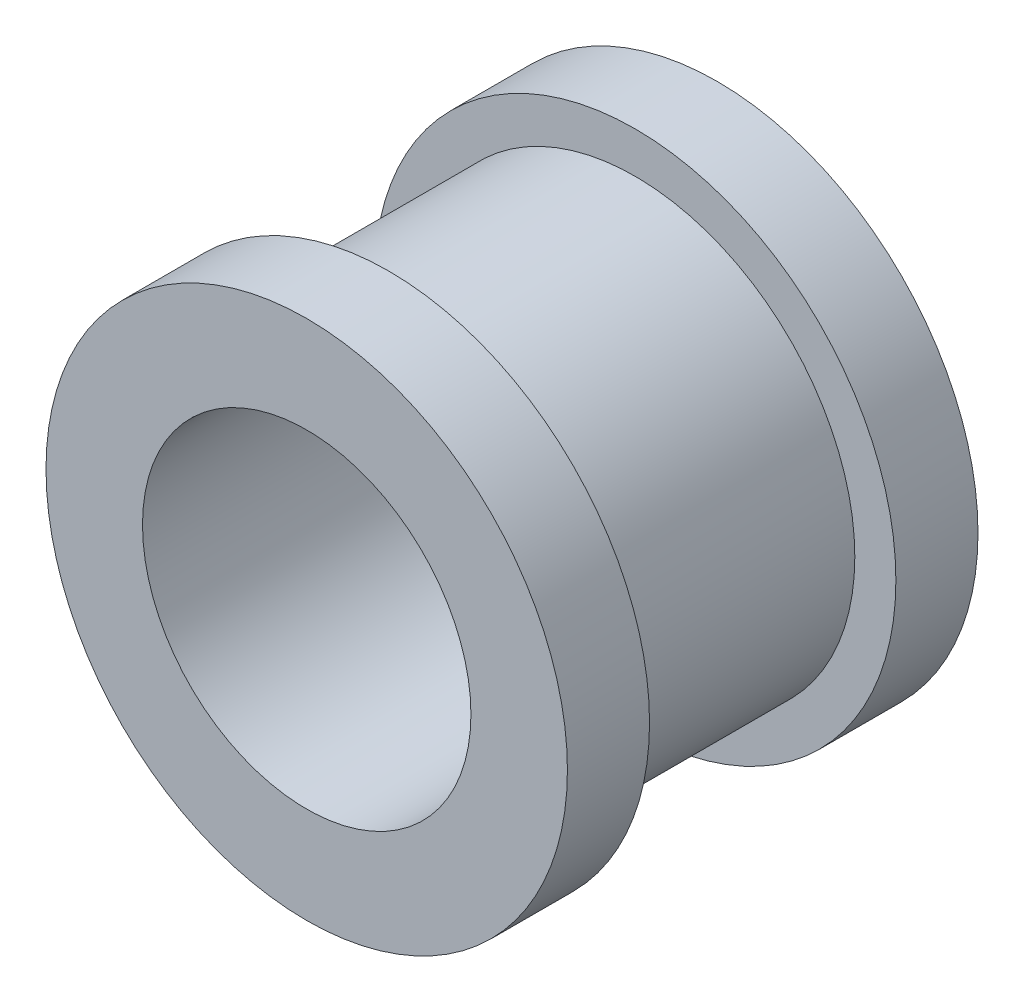
ISO-10303-21;
HEADER;
FILE_DESCRIPTION(('STEP AP214'),'2;1');
FILE_NAME('part.step','',(''),(''),'','','');
FILE_SCHEMA(('AUTOMOTIVE_DESIGN { 1 0 10303 214 1 1 1 1 }'));
ENDSEC;
DATA;
#1=APPLICATION_CONTEXT('core data for automotive mechanical design processes');
#2=APPLICATION_PROTOCOL_DEFINITION('international standard','automotive_design',2000,#1);
#3=PRODUCT_CONTEXT('',#1,'mechanical');
#4=PRODUCT('Part','Part','',(#3));
#5=PRODUCT_RELATED_PRODUCT_CATEGORY('part','',(#4));
#6=PRODUCT_DEFINITION_FORMATION('','',#4);
#7=PRODUCT_DEFINITION_CONTEXT('part definition',#1,'design');
#8=PRODUCT_DEFINITION('design','',#6,#7);
#9=PRODUCT_DEFINITION_SHAPE('','',#8);
#10=(LENGTH_UNIT() NAMED_UNIT(*) SI_UNIT(.MILLI.,.METRE.));
#11=(NAMED_UNIT(*) PLANE_ANGLE_UNIT() SI_UNIT($,.RADIAN.));
#12=(NAMED_UNIT(*) SI_UNIT($,.STERADIAN.) SOLID_ANGLE_UNIT());
#13=UNCERTAINTY_MEASURE_WITH_UNIT(LENGTH_MEASURE(1.E-05),#10,'distance_accuracy_value','');
#14=(GEOMETRIC_REPRESENTATION_CONTEXT(3) GLOBAL_UNCERTAINTY_ASSIGNED_CONTEXT((#13)) GLOBAL_UNIT_ASSIGNED_CONTEXT((#10,
#11,#12)) REPRESENTATION_CONTEXT('',''));
#15=CARTESIAN_POINT('',(0.,0.,0.));
#16=DIRECTION('',(0.,0.,1.));
#17=DIRECTION('',(1.,0.,0.));
#18=AXIS2_PLACEMENT_3D('',#15,#16,#17);
#19=CARTESIAN_POINT('',(0.,0.,10.));
#20=DIRECTION('',(0.,0.,-1.));
#21=DIRECTION('',(-1.,0.,0.));
#22=AXIS2_PLACEMENT_3D('',#19,#20,#21);
#23=CYLINDRICAL_SURFACE('',#22,6.35);
#24=CARTESIAN_POINT('',(0.,0.,0.));
#25=DIRECTION('',(0.,0.,1.));
#26=DIRECTION('',(1.,0.,0.));
#27=AXIS2_PLACEMENT_3D('',#24,#25,#26);
#28=CIRCLE('',#27,6.35);
#29=CARTESIAN_POINT('',(6.35,0.,0.));
#30=VERTEX_POINT('',#29);
#31=EDGE_CURVE('E33',#30,#30,#28,.T.);
#32=ORIENTED_EDGE('',*,*,#31,.T.);
#33=EDGE_LOOP('',(#32));
#34=FACE_BOUND('',#33,.T.);
#35=CARTESIAN_POINT('',(0.,0.,1.99999999999999));
#36=DIRECTION('',(0.,0.,1.));
#37=DIRECTION('',(1.,0.,0.));
#38=AXIS2_PLACEMENT_3D('',#35,#36,#37);
#39=CIRCLE('',#38,6.35);
#40=CARTESIAN_POINT('',(6.35,0.,1.99999999999999));
#41=VERTEX_POINT('',#40);
#42=EDGE_CURVE('E56',#41,#41,#39,.T.);
#43=ORIENTED_EDGE('',*,*,#42,.F.);
#44=EDGE_LOOP('',(#43));
#45=FACE_BOUND('',#44,.T.);
#46=ADVANCED_FACE('F30',(#34,#45),#23,.T.);
#47=CARTESIAN_POINT('',(0.,0.,10.));
#48=DIRECTION('',(0.,0.,1.));
#49=DIRECTION('',(1.,0.,0.));
#50=AXIS2_PLACEMENT_3D('',#47,#48,#49);
#51=CIRCLE('',#50,6.35);
#52=CARTESIAN_POINT('',(6.35,0.,10.));
#53=VERTEX_POINT('',#52);
#54=EDGE_CURVE('E10',#53,#53,#51,.T.);
#55=ORIENTED_EDGE('',*,*,#54,.F.);
#56=EDGE_LOOP('',(#55));
#57=FACE_BOUND('',#56,.T.);
#58=CARTESIAN_POINT('',(0.,0.,8.));
#59=DIRECTION('',(0.,0.,1.));
#60=DIRECTION('',(1.,0.,0.));
#61=AXIS2_PLACEMENT_3D('',#58,#59,#60);
#62=CIRCLE('',#61,6.35);
#63=CARTESIAN_POINT('',(6.35,0.,8.));
#64=VERTEX_POINT('',#63);
#65=EDGE_CURVE('E53',#64,#64,#62,.T.);
#66=ORIENTED_EDGE('',*,*,#65,.T.);
#67=EDGE_LOOP('',(#66));
#68=FACE_BOUND('',#67,.T.);
#69=ADVANCED_FACE('F64',(#57,#68),#23,.T.);
#70=CARTESIAN_POINT('',(0.,0.,10.));
#71=DIRECTION('',(0.,0.,1.));
#72=DIRECTION('',(1.,0.,0.));
#73=AXIS2_PLACEMENT_3D('',#70,#71,#72);
#74=PLANE('',#73);
#75=ORIENTED_EDGE('',*,*,#54,.T.);
#76=EDGE_LOOP('',(#75));
#77=FACE_BOUND('',#76,.T.);
#78=CARTESIAN_POINT('',(0.,0.,10.));
#79=DIRECTION('',(0.,0.,1.));
#80=DIRECTION('',(1.,0.,0.));
#81=AXIS2_PLACEMENT_3D('',#78,#79,#80);
#82=CIRCLE('',#81,4.);
#83=CARTESIAN_POINT('',(4.,0.,10.));
#84=VERTEX_POINT('',#83);
#85=EDGE_CURVE('E40',#84,#84,#82,.T.);
#86=ORIENTED_EDGE('',*,*,#85,.F.);
#87=EDGE_LOOP('',(#86));
#88=FACE_BOUND('',#87,.T.);
#89=ADVANCED_FACE('F69',(#77,#88),#74,.T.);
#90=CARTESIAN_POINT('',(0.,0.,0.));
#91=DIRECTION('',(0.,0.,1.));
#92=DIRECTION('',(1.,0.,0.));
#93=AXIS2_PLACEMENT_3D('',#90,#91,#92);
#94=PLANE('',#93);
#95=ORIENTED_EDGE('',*,*,#31,.F.);
#96=EDGE_LOOP('',(#95));
#97=FACE_BOUND('',#96,.T.);
#98=CARTESIAN_POINT('',(0.,0.,0.));
#99=DIRECTION('',(0.,0.,1.));
#100=DIRECTION('',(1.,0.,0.));
#101=AXIS2_PLACEMENT_3D('',#98,#99,#100);
#102=CIRCLE('',#101,4.);
#103=CARTESIAN_POINT('',(4.,0.,0.));
#104=VERTEX_POINT('',#103);
#105=EDGE_CURVE('E42',#104,#104,#102,.T.);
#106=ORIENTED_EDGE('',*,*,#105,.T.);
#107=EDGE_LOOP('',(#106));
#108=FACE_BOUND('',#107,.T.);
#109=ADVANCED_FACE('F73',(#97,#108),#94,.F.);
#110=CARTESIAN_POINT('',(0.,0.,10.));
#111=DIRECTION('',(0.,0.,-1.));
#112=DIRECTION('',(-1.,0.,0.));
#113=AXIS2_PLACEMENT_3D('',#110,#111,#112);
#114=CYLINDRICAL_SURFACE('',#113,4.);
#115=ORIENTED_EDGE('',*,*,#85,.T.);
#116=EDGE_LOOP('',(#115));
#117=FACE_BOUND('',#116,.T.);
#118=ORIENTED_EDGE('',*,*,#105,.F.);
#119=EDGE_LOOP('',(#118));
#120=FACE_BOUND('',#119,.T.);
#121=ADVANCED_FACE('F76',(#117,#120),#114,.F.);
#122=CARTESIAN_POINT('',(0.,6.35,2.));
#123=DIRECTION('',(0.,0.,1.));
#124=DIRECTION('',(1.,0.,0.));
#125=AXIS2_PLACEMENT_3D('',#122,#123,#124);
#126=PLANE('',#125);
#127=ORIENTED_EDGE('',*,*,#42,.T.);
#128=EDGE_LOOP('',(#127));
#129=FACE_BOUND('',#128,.T.);
#130=CARTESIAN_POINT('',(0.,0.,2.));
#131=DIRECTION('',(0.,0.,1.));
#132=DIRECTION('',(1.,0.,0.));
#133=AXIS2_PLACEMENT_3D('',#130,#131,#132);
#134=CIRCLE('',#133,5.35);
#135=CARTESIAN_POINT('',(5.35,0.,2.));
#136=VERTEX_POINT('',#135);
#137=EDGE_CURVE('E45',#136,#136,#134,.T.);
#138=ORIENTED_EDGE('',*,*,#137,.F.);
#139=EDGE_LOOP('',(#138));
#140=FACE_BOUND('',#139,.T.);
#141=ADVANCED_FACE('F60',(#129,#140),#126,.T.);
#142=CARTESIAN_POINT('',(0.,0.,10.));
#143=DIRECTION('',(0.,0.,1.));
#144=DIRECTION('',(1.,0.,0.));
#145=AXIS2_PLACEMENT_3D('',#142,#143,#144);
#146=CYLINDRICAL_SURFACE('',#145,5.35);
#147=ORIENTED_EDGE('',*,*,#137,.T.);
#148=EDGE_LOOP('',(#147));
#149=FACE_BOUND('',#148,.T.);
#150=CARTESIAN_POINT('',(0.,0.,8.));
#151=DIRECTION('',(0.,0.,1.));
#152=DIRECTION('',(1.,0.,0.));
#153=AXIS2_PLACEMENT_3D('',#150,#151,#152);
#154=CIRCLE('',#153,5.35);
#155=CARTESIAN_POINT('',(5.35,0.,8.));
#156=VERTEX_POINT('',#155);
#157=EDGE_CURVE('E50',#156,#156,#154,.T.);
#158=ORIENTED_EDGE('',*,*,#157,.F.);
#159=EDGE_LOOP('',(#158));
#160=FACE_BOUND('',#159,.T.);
#161=ADVANCED_FACE('F85',(#149,#160),#146,.T.);
#162=CARTESIAN_POINT('',(0.,6.35,8.));
#163=DIRECTION('',(0.,0.,-1.));
#164=DIRECTION('',(-1.,0.,0.));
#165=AXIS2_PLACEMENT_3D('',#162,#163,#164);
#166=PLANE('',#165);
#167=ORIENTED_EDGE('',*,*,#157,.T.);
#168=EDGE_LOOP('',(#167));
#169=FACE_BOUND('',#168,.T.);
#170=ORIENTED_EDGE('',*,*,#65,.F.);
#171=EDGE_LOOP('',(#170));
#172=FACE_BOUND('',#171,.T.);
#173=ADVANCED_FACE('F127',(#169,#172),#166,.T.);
#174=CLOSED_SHELL('',(#46,#69,#89,#109,#121,#141,#161,#173));
#175=MANIFOLD_SOLID_BREP('B2',#174);
#176=ADVANCED_BREP_SHAPE_REPRESENTATION('',(#18,#175),#14);
#177=SHAPE_DEFINITION_REPRESENTATION(#9,#176);
ENDSEC;
END-ISO-10303-21;
